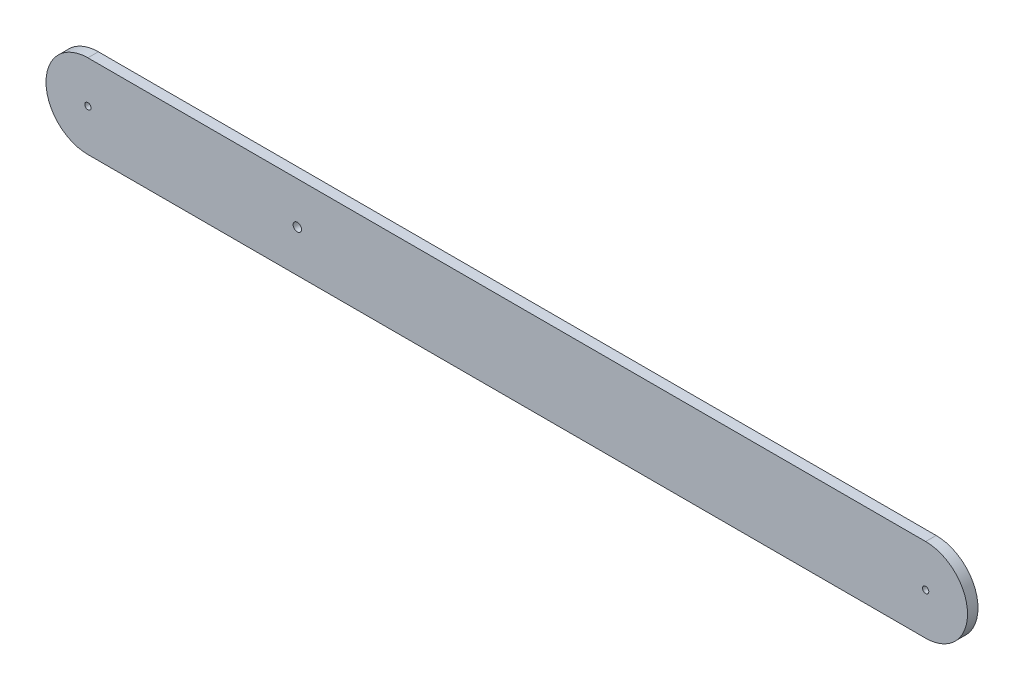
ISO-10303-21;
HEADER;
FILE_DESCRIPTION(('STEP AP214'),'2;1');
FILE_NAME('part.step','',(''),(''),'','','');
FILE_SCHEMA(('AUTOMOTIVE_DESIGN { 1 0 10303 214 1 1 1 1 }'));
ENDSEC;
DATA;
#1=APPLICATION_CONTEXT('core data for automotive mechanical design processes');
#2=APPLICATION_PROTOCOL_DEFINITION('international standard','automotive_design',2000,#1);
#3=PRODUCT_CONTEXT('',#1,'mechanical');
#4=PRODUCT('Part','Part','',(#3));
#5=PRODUCT_RELATED_PRODUCT_CATEGORY('part','',(#4));
#6=PRODUCT_DEFINITION_FORMATION('','',#4);
#7=PRODUCT_DEFINITION_CONTEXT('part definition',#1,'design');
#8=PRODUCT_DEFINITION('design','',#6,#7);
#9=PRODUCT_DEFINITION_SHAPE('','',#8);
#10=(LENGTH_UNIT() NAMED_UNIT(*) SI_UNIT(.MILLI.,.METRE.));
#11=(NAMED_UNIT(*) PLANE_ANGLE_UNIT() SI_UNIT($,.RADIAN.));
#12=(NAMED_UNIT(*) SI_UNIT($,.STERADIAN.) SOLID_ANGLE_UNIT());
#13=UNCERTAINTY_MEASURE_WITH_UNIT(LENGTH_MEASURE(1.E-05),#10,'distance_accuracy_value','');
#14=(GEOMETRIC_REPRESENTATION_CONTEXT(3) GLOBAL_UNCERTAINTY_ASSIGNED_CONTEXT((#13)) GLOBAL_UNIT_ASSIGNED_CONTEXT((#10,
#11,#12)) REPRESENTATION_CONTEXT('',''));
#15=CARTESIAN_POINT('',(0.,0.,0.));
#16=DIRECTION('',(0.,0.,1.));
#17=DIRECTION('',(1.,0.,0.));
#18=AXIS2_PLACEMENT_3D('',#15,#16,#17);
#19=CARTESIAN_POINT('',(-192.446633825944,0.,5.));
#20=DIRECTION('',(0.,0.,1.));
#21=DIRECTION('',(1.,0.,0.));
#22=AXIS2_PLACEMENT_3D('',#19,#20,#21);
#23=PLANE('',#22);
#24=CARTESIAN_POINT('',(207.553366174056,0.,5.));
#25=DIRECTION('',(0.,0.,1.));
#26=DIRECTION('',(1.,0.,0.));
#27=AXIS2_PLACEMENT_3D('',#24,#25,#26);
#28=CIRCLE('',#27,1.5);
#29=CARTESIAN_POINT('',(209.053366174056,0.,5.));
#30=VERTEX_POINT('',#29);
#31=EDGE_CURVE('E115',#30,#30,#28,.T.);
#32=ORIENTED_EDGE('',*,*,#31,.F.);
#33=EDGE_LOOP('',(#32));
#34=FACE_BOUND('',#33,.T.);
#35=CARTESIAN_POINT('',(-192.446633825944,0.,5.));
#36=DIRECTION('',(0.,0.,1.));
#37=DIRECTION('',(1.,0.,0.));
#38=AXIS2_PLACEMENT_3D('',#35,#36,#37);
#39=CIRCLE('',#38,20.);
#40=CARTESIAN_POINT('',(-192.446633825944,20.,5.));
#41=VERTEX_POINT('',#40);
#42=CARTESIAN_POINT('',(-192.446633825944,-20.,5.));
#43=VERTEX_POINT('',#42);
#44=EDGE_CURVE('E85',#41,#43,#39,.T.);
#45=ORIENTED_EDGE('',*,*,#44,.T.);
#46=DIRECTION('',(1.,0.,0.));
#47=VECTOR('',#46,1.);
#48=CARTESIAN_POINT('',(-192.446633825944,-20.,5.));
#49=LINE('',#48,#47);
#50=CARTESIAN_POINT('',(207.553366174056,-20.,5.));
#51=VERTEX_POINT('',#50);
#52=EDGE_CURVE('E80',#43,#51,#49,.T.);
#53=ORIENTED_EDGE('',*,*,#52,.T.);
#54=CARTESIAN_POINT('',(207.553366174056,0.,5.));
#55=DIRECTION('',(0.,0.,1.));
#56=DIRECTION('',(1.,0.,0.));
#57=AXIS2_PLACEMENT_3D('',#54,#55,#56);
#58=CIRCLE('',#57,20.);
#59=CARTESIAN_POINT('',(207.553366174056,20.,5.));
#60=VERTEX_POINT('',#59);
#61=EDGE_CURVE('E83',#51,#60,#58,.T.);
#62=ORIENTED_EDGE('',*,*,#61,.T.);
#63=DIRECTION('',(-1.,0.,0.));
#64=VECTOR('',#63,1.);
#65=CARTESIAN_POINT('',(-192.446633825944,20.,5.));
#66=LINE('',#65,#64);
#67=EDGE_CURVE('E50',#60,#41,#66,.T.);
#68=ORIENTED_EDGE('',*,*,#67,.T.);
#69=EDGE_LOOP('',(#45,#53,#62,#68));
#70=FACE_BOUND('',#69,.T.);
#71=CARTESIAN_POINT('',(-192.446633825944,0.,5.));
#72=DIRECTION('',(0.,0.,1.));
#73=DIRECTION('',(1.,0.,0.));
#74=AXIS2_PLACEMENT_3D('',#71,#72,#73);
#75=CIRCLE('',#74,1.5);
#76=CARTESIAN_POINT('',(-190.946633825944,0.,5.));
#77=VERTEX_POINT('',#76);
#78=EDGE_CURVE('E100',#77,#77,#75,.T.);
#79=ORIENTED_EDGE('',*,*,#78,.F.);
#80=EDGE_LOOP('',(#79));
#81=FACE_BOUND('',#80,.T.);
#82=CARTESIAN_POINT('',(-92.4466338259442,0.,5.));
#83=DIRECTION('',(0.,0.,1.));
#84=DIRECTION('',(1.,0.,0.));
#85=AXIS2_PLACEMENT_3D('',#82,#83,#84);
#86=CIRCLE('',#85,2.);
#87=CARTESIAN_POINT('',(-90.4466338259442,0.,5.));
#88=VERTEX_POINT('',#87);
#89=EDGE_CURVE('E121',#88,#88,#86,.T.);
#90=ORIENTED_EDGE('',*,*,#89,.F.);
#91=EDGE_LOOP('',(#90));
#92=FACE_BOUND('',#91,.T.);
#93=ADVANCED_FACE('F33',(#34,#70,#81,#92),#23,.T.);
#94=CARTESIAN_POINT('',(-192.446633825944,0.,0.));
#95=DIRECTION('',(0.,0.,1.));
#96=DIRECTION('',(1.,0.,0.));
#97=AXIS2_PLACEMENT_3D('',#94,#95,#96);
#98=PLANE('',#97);
#99=CARTESIAN_POINT('',(-192.446633825944,0.,0.));
#100=DIRECTION('',(0.,0.,1.));
#101=DIRECTION('',(1.,0.,0.));
#102=AXIS2_PLACEMENT_3D('',#99,#100,#101);
#103=CIRCLE('',#102,20.);
#104=CARTESIAN_POINT('',(-192.446633825944,20.,0.));
#105=VERTEX_POINT('',#104);
#106=CARTESIAN_POINT('',(-192.446633825944,-20.,0.));
#107=VERTEX_POINT('',#106);
#108=EDGE_CURVE('E97',#105,#107,#103,.T.);
#109=ORIENTED_EDGE('',*,*,#108,.F.);
#110=DIRECTION('',(-1.,0.,0.));
#111=VECTOR('',#110,1.);
#112=CARTESIAN_POINT('',(-192.446633825944,20.,0.));
#113=LINE('',#112,#111);
#114=CARTESIAN_POINT('',(207.553366174056,20.,0.));
#115=VERTEX_POINT('',#114);
#116=EDGE_CURVE('E73',#115,#105,#113,.T.);
#117=ORIENTED_EDGE('',*,*,#116,.F.);
#118=CARTESIAN_POINT('',(207.553366174056,0.,0.));
#119=DIRECTION('',(0.,0.,1.));
#120=DIRECTION('',(1.,0.,0.));
#121=AXIS2_PLACEMENT_3D('',#118,#119,#120);
#122=CIRCLE('',#121,20.);
#123=CARTESIAN_POINT('',(207.553366174056,-20.,0.));
#124=VERTEX_POINT('',#123);
#125=EDGE_CURVE('E67',#124,#115,#122,.T.);
#126=ORIENTED_EDGE('',*,*,#125,.F.);
#127=DIRECTION('',(1.,0.,0.));
#128=VECTOR('',#127,1.);
#129=CARTESIAN_POINT('',(-192.446633825944,-20.,0.));
#130=LINE('',#129,#128);
#131=EDGE_CURVE('E89',#107,#124,#130,.T.);
#132=ORIENTED_EDGE('',*,*,#131,.F.);
#133=EDGE_LOOP('',(#109,#117,#126,#132));
#134=FACE_BOUND('',#133,.T.);
#135=CARTESIAN_POINT('',(-192.446633825944,0.,0.));
#136=DIRECTION('',(0.,0.,1.));
#137=DIRECTION('',(1.,0.,0.));
#138=AXIS2_PLACEMENT_3D('',#135,#136,#137);
#139=CIRCLE('',#138,1.5);
#140=CARTESIAN_POINT('',(-190.946633825944,0.,0.));
#141=VERTEX_POINT('',#140);
#142=EDGE_CURVE('E112',#141,#141,#139,.T.);
#143=ORIENTED_EDGE('',*,*,#142,.T.);
#144=EDGE_LOOP('',(#143));
#145=FACE_BOUND('',#144,.T.);
#146=CARTESIAN_POINT('',(207.553366174056,0.,0.));
#147=DIRECTION('',(0.,0.,1.));
#148=DIRECTION('',(1.,0.,0.));
#149=AXIS2_PLACEMENT_3D('',#146,#147,#148);
#150=CIRCLE('',#149,1.5);
#151=CARTESIAN_POINT('',(209.053366174056,0.,0.));
#152=VERTEX_POINT('',#151);
#153=EDGE_CURVE('E118',#152,#152,#150,.T.);
#154=ORIENTED_EDGE('',*,*,#153,.T.);
#155=EDGE_LOOP('',(#154));
#156=FACE_BOUND('',#155,.T.);
#157=CARTESIAN_POINT('',(-92.4466338259442,0.,0.));
#158=DIRECTION('',(0.,0.,1.));
#159=DIRECTION('',(1.,0.,0.));
#160=AXIS2_PLACEMENT_3D('',#157,#158,#159);
#161=CIRCLE('',#160,2.);
#162=CARTESIAN_POINT('',(-90.4466338259442,0.,0.));
#163=VERTEX_POINT('',#162);
#164=EDGE_CURVE('E124',#163,#163,#161,.T.);
#165=ORIENTED_EDGE('',*,*,#164,.T.);
#166=EDGE_LOOP('',(#165));
#167=FACE_BOUND('',#166,.T.);
#168=ADVANCED_FACE('F108',(#134,#145,#156,#167),#98,.F.);
#169=CARTESIAN_POINT('',(-192.446633825944,0.,5.));
#170=DIRECTION('',(0.,0.,-1.));
#171=DIRECTION('',(-1.,0.,0.));
#172=AXIS2_PLACEMENT_3D('',#169,#170,#171);
#173=CYLINDRICAL_SURFACE('',#172,20.);
#174=ORIENTED_EDGE('',*,*,#108,.T.);
#175=DIRECTION('',(0.,0.,-1.));
#176=VECTOR('',#175,1.);
#177=CARTESIAN_POINT('',(-192.446633825944,-20.,5.));
#178=LINE('',#177,#176);
#179=EDGE_CURVE('E11',#43,#107,#178,.T.);
#180=ORIENTED_EDGE('',*,*,#179,.F.);
#181=ORIENTED_EDGE('',*,*,#44,.F.);
#182=DIRECTION('',(0.,0.,-1.));
#183=VECTOR('',#182,1.);
#184=CARTESIAN_POINT('',(-192.446633825944,20.,5.));
#185=LINE('',#184,#183);
#186=EDGE_CURVE('E93',#41,#105,#185,.T.);
#187=ORIENTED_EDGE('',*,*,#186,.T.);
#188=EDGE_LOOP('',(#174,#180,#181,#187));
#189=FACE_BOUND('',#188,.T.);
#190=ADVANCED_FACE('F35',(#189),#173,.T.);
#191=CARTESIAN_POINT('',(-192.446633825944,-20.,5.));
#192=DIRECTION('',(0.,1.,0.));
#193=DIRECTION('',(0.,0.,1.));
#194=AXIS2_PLACEMENT_3D('',#191,#192,#193);
#195=PLANE('',#194);
#196=ORIENTED_EDGE('',*,*,#131,.T.);
#197=DIRECTION('',(0.,0.,-1.));
#198=VECTOR('',#197,1.);
#199=CARTESIAN_POINT('',(207.553366174056,-20.,5.));
#200=LINE('',#199,#198);
#201=EDGE_CURVE('E42',#51,#124,#200,.T.);
#202=ORIENTED_EDGE('',*,*,#201,.F.);
#203=ORIENTED_EDGE('',*,*,#52,.F.);
#204=ORIENTED_EDGE('',*,*,#179,.T.);
#205=EDGE_LOOP('',(#196,#202,#203,#204));
#206=FACE_BOUND('',#205,.T.);
#207=ADVANCED_FACE('F88',(#206),#195,.F.);
#208=CARTESIAN_POINT('',(207.553366174056,0.,5.));
#209=DIRECTION('',(0.,0.,-1.));
#210=DIRECTION('',(-1.,0.,0.));
#211=AXIS2_PLACEMENT_3D('',#208,#209,#210);
#212=CYLINDRICAL_SURFACE('',#211,20.);
#213=ORIENTED_EDGE('',*,*,#125,.T.);
#214=DIRECTION('',(0.,0.,-1.));
#215=VECTOR('',#214,1.);
#216=CARTESIAN_POINT('',(207.553366174056,20.,5.));
#217=LINE('',#216,#215);
#218=EDGE_CURVE('E90',#60,#115,#217,.T.);
#219=ORIENTED_EDGE('',*,*,#218,.F.);
#220=ORIENTED_EDGE('',*,*,#61,.F.);
#221=ORIENTED_EDGE('',*,*,#201,.T.);
#222=EDGE_LOOP('',(#213,#219,#220,#221));
#223=FACE_BOUND('',#222,.T.);
#224=ADVANCED_FACE('F91',(#223),#212,.T.);
#225=CARTESIAN_POINT('',(-192.446633825944,20.,5.));
#226=DIRECTION('',(0.,-1.,0.));
#227=DIRECTION('',(0.,0.,-1.));
#228=AXIS2_PLACEMENT_3D('',#225,#226,#227);
#229=PLANE('',#228);
#230=ORIENTED_EDGE('',*,*,#116,.T.);
#231=ORIENTED_EDGE('',*,*,#186,.F.);
#232=ORIENTED_EDGE('',*,*,#67,.F.);
#233=ORIENTED_EDGE('',*,*,#218,.T.);
#234=EDGE_LOOP('',(#230,#231,#232,#233));
#235=FACE_BOUND('',#234,.T.);
#236=ADVANCED_FACE('F105',(#235),#229,.F.);
#237=CARTESIAN_POINT('',(-192.446633825944,0.,5.));
#238=DIRECTION('',(0.,0.,-1.));
#239=DIRECTION('',(-1.,0.,0.));
#240=AXIS2_PLACEMENT_3D('',#237,#238,#239);
#241=CYLINDRICAL_SURFACE('',#240,1.5);
#242=ORIENTED_EDGE('',*,*,#78,.T.);
#243=EDGE_LOOP('',(#242));
#244=FACE_BOUND('',#243,.T.);
#245=ORIENTED_EDGE('',*,*,#142,.F.);
#246=EDGE_LOOP('',(#245));
#247=FACE_BOUND('',#246,.T.);
#248=ADVANCED_FACE('F142',(#244,#247),#241,.F.);
#249=CARTESIAN_POINT('',(207.553366174056,0.,5.));
#250=DIRECTION('',(0.,0.,-1.));
#251=DIRECTION('',(-1.,0.,0.));
#252=AXIS2_PLACEMENT_3D('',#249,#250,#251);
#253=CYLINDRICAL_SURFACE('',#252,1.5);
#254=ORIENTED_EDGE('',*,*,#31,.T.);
#255=EDGE_LOOP('',(#254));
#256=FACE_BOUND('',#255,.T.);
#257=ORIENTED_EDGE('',*,*,#153,.F.);
#258=EDGE_LOOP('',(#257));
#259=FACE_BOUND('',#258,.T.);
#260=ADVANCED_FACE('F188',(#256,#259),#253,.F.);
#261=CARTESIAN_POINT('',(-92.4466338259442,0.,5.));
#262=DIRECTION('',(0.,0.,-1.));
#263=DIRECTION('',(-1.,0.,0.));
#264=AXIS2_PLACEMENT_3D('',#261,#262,#263);
#265=CYLINDRICAL_SURFACE('',#264,2.);
#266=ORIENTED_EDGE('',*,*,#89,.T.);
#267=EDGE_LOOP('',(#266));
#268=FACE_BOUND('',#267,.T.);
#269=ORIENTED_EDGE('',*,*,#164,.F.);
#270=EDGE_LOOP('',(#269));
#271=FACE_BOUND('',#270,.T.);
#272=ADVANCED_FACE('F130',(#268,#271),#265,.F.);
#273=CLOSED_SHELL('',(#93,#168,#190,#207,#224,#236,#248,#260,#272));
#274=MANIFOLD_SOLID_BREP('B2',#273);
#275=ADVANCED_BREP_SHAPE_REPRESENTATION('',(#18,#274),#14);
#276=SHAPE_DEFINITION_REPRESENTATION(#9,#275);
ENDSEC;
END-ISO-10303-21;
